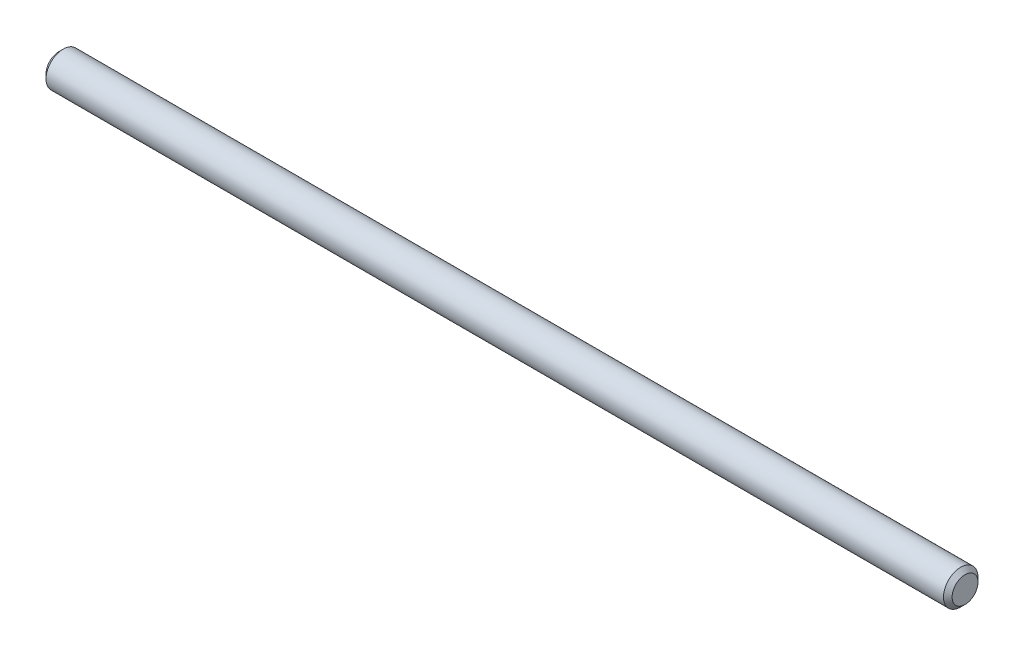
ISO-10303-21;
HEADER;
FILE_DESCRIPTION(('STEP AP214'),'2;1');
FILE_NAME('part.step','',(''),(''),'','','');
FILE_SCHEMA(('AUTOMOTIVE_DESIGN { 1 0 10303 214 1 1 1 1 }'));
ENDSEC;
DATA;
#1=APPLICATION_CONTEXT('core data for automotive mechanical design processes');
#2=APPLICATION_PROTOCOL_DEFINITION('international standard','automotive_design',2000,#1);
#3=PRODUCT_CONTEXT('',#1,'mechanical');
#4=PRODUCT('Part','Part','',(#3));
#5=PRODUCT_RELATED_PRODUCT_CATEGORY('part','',(#4));
#6=PRODUCT_DEFINITION_FORMATION('','',#4);
#7=PRODUCT_DEFINITION_CONTEXT('part definition',#1,'design');
#8=PRODUCT_DEFINITION('design','',#6,#7);
#9=PRODUCT_DEFINITION_SHAPE('','',#8);
#10=(LENGTH_UNIT() NAMED_UNIT(*) SI_UNIT(.MILLI.,.METRE.));
#11=(NAMED_UNIT(*) PLANE_ANGLE_UNIT() SI_UNIT($,.RADIAN.));
#12=(NAMED_UNIT(*) SI_UNIT($,.STERADIAN.) SOLID_ANGLE_UNIT());
#13=UNCERTAINTY_MEASURE_WITH_UNIT(LENGTH_MEASURE(1.E-05),#10,'distance_accuracy_value','');
#14=(GEOMETRIC_REPRESENTATION_CONTEXT(3) GLOBAL_UNCERTAINTY_ASSIGNED_CONTEXT((#13)) GLOBAL_UNIT_ASSIGNED_CONTEXT((#10,
#11,#12)) REPRESENTATION_CONTEXT('',''));
#15=CARTESIAN_POINT('',(0.,0.,0.));
#16=DIRECTION('',(0.,0.,1.));
#17=DIRECTION('',(1.,0.,0.));
#18=AXIS2_PLACEMENT_3D('',#15,#16,#17);
#19=CARTESIAN_POINT('',(52.5,0.,0.));
#20=DIRECTION('',(-1.,0.,0.));
#21=DIRECTION('',(0.,0.,1.));
#22=AXIS2_PLACEMENT_3D('',#19,#20,#21);
#23=CYLINDRICAL_SURFACE('',#22,2.);
#24=CARTESIAN_POINT('',(-52.,0.,0.));
#25=DIRECTION('',(1.,0.,0.));
#26=DIRECTION('',(0.,0.,-1.));
#27=AXIS2_PLACEMENT_3D('',#24,#25,#26);
#28=CIRCLE('',#27,2.);
#29=CARTESIAN_POINT('',(-52.,0.,-2.));
#30=VERTEX_POINT('',#29);
#31=EDGE_CURVE('E47',#30,#30,#28,.T.);
#32=ORIENTED_EDGE('',*,*,#31,.T.);
#33=EDGE_LOOP('',(#32));
#34=FACE_BOUND('',#33,.T.);
#35=CARTESIAN_POINT('',(52.,0.,0.));
#36=DIRECTION('',(1.,0.,0.));
#37=DIRECTION('',(0.,0.,-1.));
#38=AXIS2_PLACEMENT_3D('',#35,#36,#37);
#39=CIRCLE('',#38,2.);
#40=CARTESIAN_POINT('',(52.,0.,-2.));
#41=VERTEX_POINT('',#40);
#42=EDGE_CURVE('E51',#41,#41,#39,.F.);
#43=ORIENTED_EDGE('',*,*,#42,.T.);
#44=EDGE_LOOP('',(#43));
#45=FACE_BOUND('',#44,.T.);
#46=ADVANCED_FACE('F36',(#34,#45),#23,.T.);
#47=CARTESIAN_POINT('',(52.5,0.,0.));
#48=DIRECTION('',(1.,0.,0.));
#49=DIRECTION('',(0.,0.,-1.));
#50=AXIS2_PLACEMENT_3D('',#47,#48,#49);
#51=PLANE('',#50);
#52=CARTESIAN_POINT('',(52.5,0.,0.));
#53=DIRECTION('',(1.,0.,0.));
#54=DIRECTION('',(0.,0.,-1.));
#55=AXIS2_PLACEMENT_3D('',#52,#53,#54);
#56=CIRCLE('',#55,1.5);
#57=CARTESIAN_POINT('',(52.5,0.,-1.5));
#58=VERTEX_POINT('',#57);
#59=EDGE_CURVE('E10',#58,#58,#56,.T.);
#60=ORIENTED_EDGE('',*,*,#59,.T.);
#61=EDGE_LOOP('',(#60));
#62=FACE_BOUND('',#61,.T.);
#63=ADVANCED_FACE('F67',(#62),#51,.T.);
#64=CARTESIAN_POINT('',(-52.5,0.,0.));
#65=DIRECTION('',(1.,0.,0.));
#66=DIRECTION('',(0.,0.,-1.));
#67=AXIS2_PLACEMENT_3D('',#64,#65,#66);
#68=PLANE('',#67);
#69=CARTESIAN_POINT('',(-52.5,0.,0.));
#70=DIRECTION('',(1.,0.,0.));
#71=DIRECTION('',(0.,0.,-1.));
#72=AXIS2_PLACEMENT_3D('',#69,#70,#71);
#73=CIRCLE('',#72,1.5);
#74=CARTESIAN_POINT('',(-52.5,0.,-1.5));
#75=VERTEX_POINT('',#74);
#76=EDGE_CURVE('E43',#75,#75,#73,.F.);
#77=ORIENTED_EDGE('',*,*,#76,.T.);
#78=EDGE_LOOP('',(#77));
#79=FACE_BOUND('',#78,.T.);
#80=ADVANCED_FACE('F64',(#79),#68,.F.);
#81=CARTESIAN_POINT('',(-52.,0.,0.));
#82=DIRECTION('',(1.,0.,0.));
#83=DIRECTION('',(0.,0.,-1.));
#84=AXIS2_PLACEMENT_3D('',#81,#82,#83);
#85=CONICAL_SURFACE('',#84,2.,0.785398163397433);
#86=ORIENTED_EDGE('',*,*,#76,.F.);
#87=EDGE_LOOP('',(#86));
#88=FACE_BOUND('',#87,.T.);
#89=ORIENTED_EDGE('',*,*,#31,.F.);
#90=EDGE_LOOP('',(#89));
#91=FACE_BOUND('',#90,.T.);
#92=ADVANCED_FACE('F60',(#88,#91),#85,.T.);
#93=CARTESIAN_POINT('',(52.5,0.,0.));
#94=DIRECTION('',(-1.,0.,0.));
#95=DIRECTION('',(0.,0.,1.));
#96=AXIS2_PLACEMENT_3D('',#93,#94,#95);
#97=CONICAL_SURFACE('',#96,1.5,0.785398163397453);
#98=ORIENTED_EDGE('',*,*,#42,.F.);
#99=EDGE_LOOP('',(#98));
#100=FACE_BOUND('',#99,.T.);
#101=ORIENTED_EDGE('',*,*,#59,.F.);
#102=EDGE_LOOP('',(#101));
#103=FACE_BOUND('',#102,.T.);
#104=ADVANCED_FACE('F38',(#100,#103),#97,.T.);
#105=CLOSED_SHELL('',(#46,#63,#80,#92,#104));
#106=MANIFOLD_SOLID_BREP('B2',#105);
#107=ADVANCED_BREP_SHAPE_REPRESENTATION('',(#18,#106),#14);
#108=SHAPE_DEFINITION_REPRESENTATION(#9,#107);
ENDSEC;
END-ISO-10303-21;
